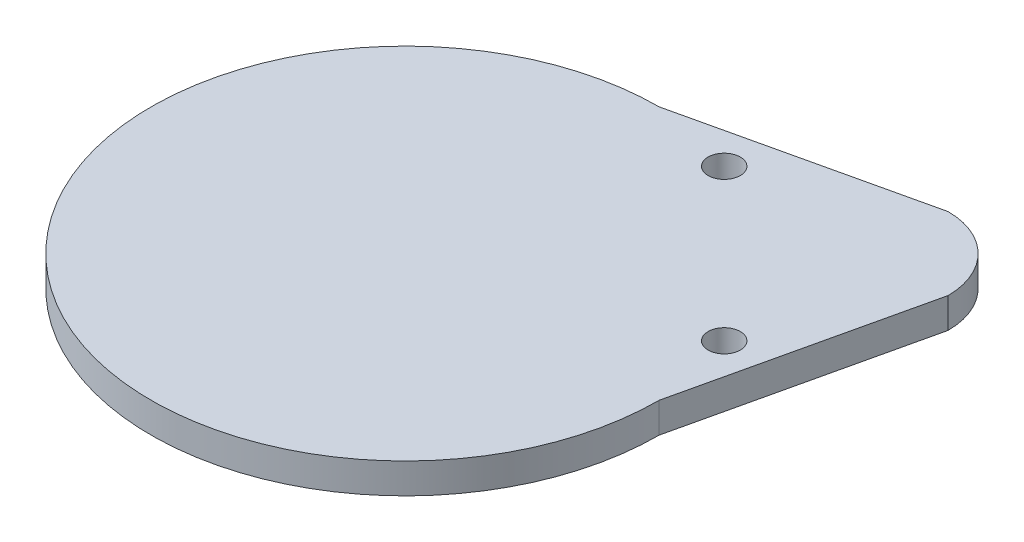
ISO-10303-21;
HEADER;
FILE_DESCRIPTION(('STEP AP214'),'2;1');
FILE_NAME('part.step','',(''),(''),'','','');
FILE_SCHEMA(('AUTOMOTIVE_DESIGN { 1 0 10303 214 1 1 1 1 }'));
ENDSEC;
DATA;
#1=APPLICATION_CONTEXT('core data for automotive mechanical design processes');
#2=APPLICATION_PROTOCOL_DEFINITION('international standard','automotive_design',2000,#1);
#3=PRODUCT_CONTEXT('',#1,'mechanical');
#4=PRODUCT('Part','Part','',(#3));
#5=PRODUCT_RELATED_PRODUCT_CATEGORY('part','',(#4));
#6=PRODUCT_DEFINITION_FORMATION('','',#4);
#7=PRODUCT_DEFINITION_CONTEXT('part definition',#1,'design');
#8=PRODUCT_DEFINITION('design','',#6,#7);
#9=PRODUCT_DEFINITION_SHAPE('','',#8);
#10=(LENGTH_UNIT() NAMED_UNIT(*) SI_UNIT(.MILLI.,.METRE.));
#11=(NAMED_UNIT(*) PLANE_ANGLE_UNIT() SI_UNIT($,.RADIAN.));
#12=(NAMED_UNIT(*) SI_UNIT($,.STERADIAN.) SOLID_ANGLE_UNIT());
#13=UNCERTAINTY_MEASURE_WITH_UNIT(LENGTH_MEASURE(1.E-05),#10,'distance_accuracy_value','');
#14=(GEOMETRIC_REPRESENTATION_CONTEXT(3) GLOBAL_UNCERTAINTY_ASSIGNED_CONTEXT((#13)) GLOBAL_UNIT_ASSIGNED_CONTEXT((#10,
#11,#12)) REPRESENTATION_CONTEXT('',''));
#15=CARTESIAN_POINT('',(0.,0.,0.));
#16=DIRECTION('',(0.,0.,1.));
#17=DIRECTION('',(1.,0.,0.));
#18=AXIS2_PLACEMENT_3D('',#15,#16,#17);
#19=CARTESIAN_POINT('',(49.3914086658803,0.,-49.3914086658803));
#20=DIRECTION('',(0.,1.,0.));
#21=DIRECTION('',(0.,0.,1.));
#22=AXIS2_PLACEMENT_3D('',#19,#20,#21);
#23=CYLINDRICAL_SURFACE('',#22,12.7381);
#24=CARTESIAN_POINT('',(49.3914086658803,0.,-49.3914086658803));
#25=DIRECTION('',(0.,1.,0.));
#26=DIRECTION('',(0.,0.,1.));
#27=AXIS2_PLACEMENT_3D('',#24,#25,#26);
#28=CIRCLE('',#27,12.7381);
#29=CARTESIAN_POINT('',(49.3914086658803,0.,-36.6533086658803));
#30=VERTEX_POINT('',#29);
#31=EDGE_CURVE('E247',#30,#30,#28,.T.);
#32=ORIENTED_EDGE('',*,*,#31,.F.);
#33=EDGE_LOOP('',(#32));
#34=FACE_BOUND('',#33,.T.);
#35=CARTESIAN_POINT('',(49.3914086658803,3.175,-49.3914086658803));
#36=DIRECTION('',(0.,1.,0.));
#37=DIRECTION('',(0.,0.,1.));
#38=AXIS2_PLACEMENT_3D('',#35,#36,#37);
#39=CIRCLE('',#38,12.7381);
#40=CARTESIAN_POINT('',(49.3914086658803,3.175,-36.6533086658803));
#41=VERTEX_POINT('',#40);
#42=EDGE_CURVE('E11',#41,#41,#39,.F.);
#43=ORIENTED_EDGE('',*,*,#42,.F.);
#44=EDGE_LOOP('',(#43));
#45=FACE_BOUND('',#44,.T.);
#46=ADVANCED_FACE('F32',(#34,#45),#23,.F.);
#47=CARTESIAN_POINT('',(0.,0.,0.));
#48=DIRECTION('',(0.,1.,0.));
#49=DIRECTION('',(0.,0.,1.));
#50=AXIS2_PLACEMENT_3D('',#47,#48,#49);
#51=CYLINDRICAL_SURFACE('',#50,44.4881);
#52=CARTESIAN_POINT('',(0.,0.,0.));
#53=DIRECTION('',(0.,1.,0.));
#54=DIRECTION('',(0.,0.,1.));
#55=AXIS2_PLACEMENT_3D('',#52,#53,#54);
#56=CIRCLE('',#55,44.4881);
#57=CARTESIAN_POINT('',(0.,0.,44.4881));
#58=VERTEX_POINT('',#57);
#59=EDGE_CURVE('E103',#58,#58,#56,.T.);
#60=ORIENTED_EDGE('',*,*,#59,.F.);
#61=EDGE_LOOP('',(#60));
#62=FACE_BOUND('',#61,.T.);
#63=CARTESIAN_POINT('',(0.,3.175,0.));
#64=DIRECTION('',(0.,1.,0.));
#65=DIRECTION('',(0.,0.,1.));
#66=AXIS2_PLACEMENT_3D('',#63,#64,#65);
#67=CIRCLE('',#66,44.4881);
#68=CARTESIAN_POINT('',(0.,3.175,44.4881));
#69=VERTEX_POINT('',#68);
#70=EDGE_CURVE('E41',#69,#69,#67,.F.);
#71=ORIENTED_EDGE('',*,*,#70,.F.);
#72=EDGE_LOOP('',(#71));
#73=FACE_BOUND('',#72,.T.);
#74=ADVANCED_FACE('F114',(#62,#73),#51,.F.);
#75=CARTESIAN_POINT('',(0.,6.35,0.));
#76=DIRECTION('',(0.,-1.,0.));
#77=DIRECTION('',(0.,0.,-1.));
#78=AXIS2_PLACEMENT_3D('',#75,#76,#77);
#79=CYLINDRICAL_SURFACE('',#78,53.3781);
#80=CARTESIAN_POINT('',(0.,0.,0.));
#81=DIRECTION('',(0.,1.,0.));
#82=DIRECTION('',(0.,0.,1.));
#83=AXIS2_PLACEMENT_3D('',#80,#81,#82);
#84=CIRCLE('',#83,53.3781);
#85=CARTESIAN_POINT('',(0.,0.,-53.3781));
#86=VERTEX_POINT('',#85);
#87=CARTESIAN_POINT('',(53.3781,0.,0.));
#88=VERTEX_POINT('',#87);
#89=EDGE_CURVE('E100',#86,#88,#84,.T.);
#90=ORIENTED_EDGE('',*,*,#89,.T.);
#91=DIRECTION('',(0.,-1.,0.));
#92=VECTOR('',#91,1.);
#93=CARTESIAN_POINT('',(53.3781,6.35,0.));
#94=LINE('',#93,#92);
#95=CARTESIAN_POINT('',(53.3781,6.35,0.));
#96=VERTEX_POINT('',#95);
#97=EDGE_CURVE('E91',#96,#88,#94,.T.);
#98=ORIENTED_EDGE('',*,*,#97,.F.);
#99=CARTESIAN_POINT('',(0.,6.35,0.));
#100=DIRECTION('',(0.,1.,0.));
#101=DIRECTION('',(0.,0.,1.));
#102=AXIS2_PLACEMENT_3D('',#99,#100,#101);
#103=CIRCLE('',#102,53.3781);
#104=CARTESIAN_POINT('',(0.,6.35,-53.3781));
#105=VERTEX_POINT('',#104);
#106=EDGE_CURVE('E85',#105,#96,#103,.T.);
#107=ORIENTED_EDGE('',*,*,#106,.F.);
#108=DIRECTION('',(0.,-1.,0.));
#109=VECTOR('',#108,1.);
#110=CARTESIAN_POINT('',(0.,6.35,-53.3781));
#111=LINE('',#110,#109);
#112=EDGE_CURVE('E96',#105,#86,#111,.T.);
#113=ORIENTED_EDGE('',*,*,#112,.T.);
#114=EDGE_LOOP('',(#90,#98,#107,#113));
#115=FACE_BOUND('',#114,.T.);
#116=ADVANCED_FACE('F34',(#115),#79,.T.);
#117=CARTESIAN_POINT('',(53.3781,6.35,0.));
#118=DIRECTION('',(-0.974850171968633,0.,-0.222861262252387));
#119=DIRECTION('',(-0.222861262252387,0.,0.974850171968633));
#120=AXIS2_PLACEMENT_3D('',#117,#118,#119);
#121=PLANE('',#120);
#122=DIRECTION('',(0.222861262252387,0.,-0.974850171968633));
#123=VECTOR('',#122,1.);
#124=CARTESIAN_POINT('',(53.3781,0.,0.));
#125=LINE('',#124,#123);
#126=CARTESIAN_POINT('',(64.6695086658803,0.,-49.3914086658803));
#127=VERTEX_POINT('',#126);
#128=EDGE_CURVE('E90',#88,#127,#125,.T.);
#129=ORIENTED_EDGE('',*,*,#128,.T.);
#130=DIRECTION('',(0.,-1.,0.));
#131=VECTOR('',#130,1.);
#132=CARTESIAN_POINT('',(64.6695086658803,6.35,-49.3914086658803));
#133=LINE('',#132,#131);
#134=CARTESIAN_POINT('',(64.6695086658803,6.35,-49.3914086658803));
#135=VERTEX_POINT('',#134);
#136=EDGE_CURVE('E88',#135,#127,#133,.T.);
#137=ORIENTED_EDGE('',*,*,#136,.F.);
#138=DIRECTION('',(0.222861262252387,0.,-0.974850171968633));
#139=VECTOR('',#138,1.);
#140=CARTESIAN_POINT('',(53.3781,6.35,0.));
#141=LINE('',#140,#139);
#142=EDGE_CURVE('E80',#96,#135,#141,.T.);
#143=ORIENTED_EDGE('',*,*,#142,.F.);
#144=ORIENTED_EDGE('',*,*,#97,.T.);
#145=EDGE_LOOP('',(#129,#137,#143,#144));
#146=FACE_BOUND('',#145,.T.);
#147=ADVANCED_FACE('F89',(#146),#121,.F.);
#148=CARTESIAN_POINT('',(49.3914086658803,6.35,-49.3914086658803));
#149=DIRECTION('',(0.,-1.,0.));
#150=DIRECTION('',(0.,0.,-1.));
#151=AXIS2_PLACEMENT_3D('',#148,#149,#150);
#152=CYLINDRICAL_SURFACE('',#151,15.2781);
#153=CARTESIAN_POINT('',(49.3914086658803,0.,-49.3914086658803));
#154=DIRECTION('',(0.,1.,0.));
#155=DIRECTION('',(0.,0.,-1.));
#156=AXIS2_PLACEMENT_3D('',#153,#154,#155);
#157=CIRCLE('',#156,15.2781);
#158=CARTESIAN_POINT('',(49.3914086658803,0.,-64.6695086658803));
#159=VERTEX_POINT('',#158);
#160=EDGE_CURVE('E66',#127,#159,#157,.T.);
#161=ORIENTED_EDGE('',*,*,#160,.T.);
#162=DIRECTION('',(0.,-1.,0.));
#163=VECTOR('',#162,1.);
#164=CARTESIAN_POINT('',(49.3914086658803,6.35,-64.6695086658803));
#165=LINE('',#164,#163);
#166=CARTESIAN_POINT('',(49.3914086658803,6.35,-64.6695086658803));
#167=VERTEX_POINT('',#166);
#168=EDGE_CURVE('E92',#167,#159,#165,.T.);
#169=ORIENTED_EDGE('',*,*,#168,.F.);
#170=CARTESIAN_POINT('',(49.3914086658803,6.35,-49.3914086658803));
#171=DIRECTION('',(0.,1.,0.));
#172=DIRECTION('',(0.,0.,-1.));
#173=AXIS2_PLACEMENT_3D('',#170,#171,#172);
#174=CIRCLE('',#173,15.2781);
#175=EDGE_CURVE('E83',#135,#167,#174,.T.);
#176=ORIENTED_EDGE('',*,*,#175,.F.);
#177=ORIENTED_EDGE('',*,*,#136,.T.);
#178=EDGE_LOOP('',(#161,#169,#176,#177));
#179=FACE_BOUND('',#178,.T.);
#180=ADVANCED_FACE('F94',(#179),#152,.T.);
#181=CARTESIAN_POINT('',(0.,6.35,-53.3781));
#182=DIRECTION('',(0.222861262252387,0.,0.974850171968633));
#183=DIRECTION('',(0.974850171968633,0.,-0.222861262252387));
#184=AXIS2_PLACEMENT_3D('',#181,#182,#183);
#185=PLANE('',#184);
#186=DIRECTION('',(-0.974850171968633,0.,0.222861262252387));
#187=VECTOR('',#186,1.);
#188=CARTESIAN_POINT('',(0.,0.,-53.3781));
#189=LINE('',#188,#187);
#190=EDGE_CURVE('E72',#159,#86,#189,.T.);
#191=ORIENTED_EDGE('',*,*,#190,.T.);
#192=ORIENTED_EDGE('',*,*,#112,.F.);
#193=DIRECTION('',(-0.974850171968633,0.,0.222861262252387));
#194=VECTOR('',#193,1.);
#195=CARTESIAN_POINT('',(0.,6.35,-53.3781));
#196=LINE('',#195,#194);
#197=EDGE_CURVE('E49',#167,#105,#196,.T.);
#198=ORIENTED_EDGE('',*,*,#197,.F.);
#199=ORIENTED_EDGE('',*,*,#168,.T.);
#200=EDGE_LOOP('',(#191,#192,#198,#199));
#201=FACE_BOUND('',#200,.T.);
#202=ADVANCED_FACE('F131',(#201),#185,.F.);
#203=CARTESIAN_POINT('',(0.,6.35,0.));
#204=DIRECTION('',(0.,1.,0.));
#205=DIRECTION('',(0.,0.,1.));
#206=AXIS2_PLACEMENT_3D('',#203,#204,#205);
#207=PLANE('',#206);
#208=CARTESIAN_POINT('',(49.3914086658803,6.35,-17.6414086658803));
#209=DIRECTION('',(0.,1.,0.));
#210=DIRECTION('',(0.,0.,1.));
#211=AXIS2_PLACEMENT_3D('',#208,#209,#210);
#212=CIRCLE('',#211,3.37819999999999);
#213=CARTESIAN_POINT('',(49.3914086658803,6.35,-14.2632086658803));
#214=VERTEX_POINT('',#213);
#215=EDGE_CURVE('E234',#214,#214,#212,.T.);
#216=ORIENTED_EDGE('',*,*,#215,.F.);
#217=EDGE_LOOP('',(#216));
#218=FACE_BOUND('',#217,.T.);
#219=CARTESIAN_POINT('',(17.6414086658803,6.35,-49.3914086658803));
#220=DIRECTION('',(0.,1.,0.));
#221=DIRECTION('',(0.,0.,1.));
#222=AXIS2_PLACEMENT_3D('',#219,#220,#221);
#223=CIRCLE('',#222,3.3782);
#224=CARTESIAN_POINT('',(17.6414086658803,6.35,-46.0132086658803));
#225=VERTEX_POINT('',#224);
#226=EDGE_CURVE('E244',#225,#225,#223,.T.);
#227=ORIENTED_EDGE('',*,*,#226,.F.);
#228=EDGE_LOOP('',(#227));
#229=FACE_BOUND('',#228,.T.);
#230=ORIENTED_EDGE('',*,*,#106,.T.);
#231=ORIENTED_EDGE('',*,*,#142,.T.);
#232=ORIENTED_EDGE('',*,*,#175,.T.);
#233=ORIENTED_EDGE('',*,*,#197,.T.);
#234=EDGE_LOOP('',(#230,#231,#232,#233));
#235=FACE_BOUND('',#234,.T.);
#236=ADVANCED_FACE('F81',(#218,#229,#235),#207,.T.);
#237=CARTESIAN_POINT('',(0.,0.,0.));
#238=DIRECTION('',(0.,1.,0.));
#239=DIRECTION('',(0.,0.,1.));
#240=AXIS2_PLACEMENT_3D('',#237,#238,#239);
#241=PLANE('',#240);
#242=CARTESIAN_POINT('',(49.3914086658803,0.,-17.6414086658803));
#243=DIRECTION('',(0.,-1.,0.));
#244=DIRECTION('',(0.,0.,-1.));
#245=AXIS2_PLACEMENT_3D('',#242,#243,#244);
#246=CIRCLE('',#245,3.3782);
#247=CARTESIAN_POINT('',(49.3914086658803,0.,-21.0196086658803));
#248=VERTEX_POINT('',#247);
#249=EDGE_CURVE('E237',#248,#248,#246,.T.);
#250=ORIENTED_EDGE('',*,*,#249,.F.);
#251=EDGE_LOOP('',(#250));
#252=FACE_BOUND('',#251,.T.);
#253=CARTESIAN_POINT('',(17.6414086658803,0.,-49.3914086658803));
#254=DIRECTION('',(0.,-1.,0.));
#255=DIRECTION('',(0.,0.,-1.));
#256=AXIS2_PLACEMENT_3D('',#253,#254,#255);
#257=CIRCLE('',#256,3.3782);
#258=CARTESIAN_POINT('',(17.6414086658803,0.,-52.7696086658803));
#259=VERTEX_POINT('',#258);
#260=EDGE_CURVE('E239',#259,#259,#257,.T.);
#261=ORIENTED_EDGE('',*,*,#260,.F.);
#262=EDGE_LOOP('',(#261));
#263=FACE_BOUND('',#262,.T.);
#264=ORIENTED_EDGE('',*,*,#31,.T.);
#265=EDGE_LOOP('',(#264));
#266=FACE_BOUND('',#265,.T.);
#267=ORIENTED_EDGE('',*,*,#59,.T.);
#268=EDGE_LOOP('',(#267));
#269=FACE_BOUND('',#268,.T.);
#270=ORIENTED_EDGE('',*,*,#89,.F.);
#271=ORIENTED_EDGE('',*,*,#190,.F.);
#272=ORIENTED_EDGE('',*,*,#160,.F.);
#273=ORIENTED_EDGE('',*,*,#128,.F.);
#274=EDGE_LOOP('',(#270,#271,#272,#273));
#275=FACE_BOUND('',#274,.T.);
#276=ADVANCED_FACE('F130',(#252,#263,#266,#269,#275),#241,.F.);
#277=CARTESIAN_POINT('',(17.6414086658803,0.,-49.3914086658803));
#278=DIRECTION('',(0.,-1.,0.));
#279=DIRECTION('',(0.,0.,-1.));
#280=AXIS2_PLACEMENT_3D('',#277,#278,#279);
#281=CYLINDRICAL_SURFACE('',#280,3.3782);
#282=ORIENTED_EDGE('',*,*,#226,.T.);
#283=EDGE_LOOP('',(#282));
#284=FACE_BOUND('',#283,.T.);
#285=ORIENTED_EDGE('',*,*,#260,.T.);
#286=EDGE_LOOP('',(#285));
#287=FACE_BOUND('',#286,.T.);
#288=ADVANCED_FACE('F135',(#284,#287),#281,.F.);
#289=CARTESIAN_POINT('',(49.3914086658803,0.,-17.6414086658803));
#290=DIRECTION('',(0.,-1.,0.));
#291=DIRECTION('',(0.,0.,-1.));
#292=AXIS2_PLACEMENT_3D('',#289,#290,#291);
#293=CYLINDRICAL_SURFACE('',#292,3.37819999999999);
#294=ORIENTED_EDGE('',*,*,#215,.T.);
#295=EDGE_LOOP('',(#294));
#296=FACE_BOUND('',#295,.T.);
#297=ORIENTED_EDGE('',*,*,#249,.T.);
#298=EDGE_LOOP('',(#297));
#299=FACE_BOUND('',#298,.T.);
#300=ADVANCED_FACE('F169',(#296,#299),#293,.F.);
#301=CARTESIAN_POINT('',(0.,3.175,0.));
#302=DIRECTION('',(0.,1.,0.));
#303=DIRECTION('',(0.,0.,1.));
#304=AXIS2_PLACEMENT_3D('',#301,#302,#303);
#305=PLANE('',#304);
#306=ORIENTED_EDGE('',*,*,#70,.T.);
#307=EDGE_LOOP('',(#306));
#308=FACE_BOUND('',#307,.T.);
#309=ADVANCED_FACE('F112',(#308),#305,.F.);
#310=CARTESIAN_POINT('',(49.3914086658803,3.175,-49.3914086658803));
#311=DIRECTION('',(0.,1.,0.));
#312=DIRECTION('',(0.,0.,1.));
#313=AXIS2_PLACEMENT_3D('',#310,#311,#312);
#314=PLANE('',#313);
#315=ORIENTED_EDGE('',*,*,#42,.T.);
#316=EDGE_LOOP('',(#315));
#317=FACE_BOUND('',#316,.T.);
#318=ADVANCED_FACE('F183',(#317),#314,.F.);
#319=CLOSED_SHELL('',(#46,#74,#116,#147,#180,#202,#236,#276,#288,#300,#309,#318));
#320=MANIFOLD_SOLID_BREP('B2',#319);
#321=ADVANCED_BREP_SHAPE_REPRESENTATION('',(#18,#320),#14);
#322=SHAPE_DEFINITION_REPRESENTATION(#9,#321);
ENDSEC;
END-ISO-10303-21;
